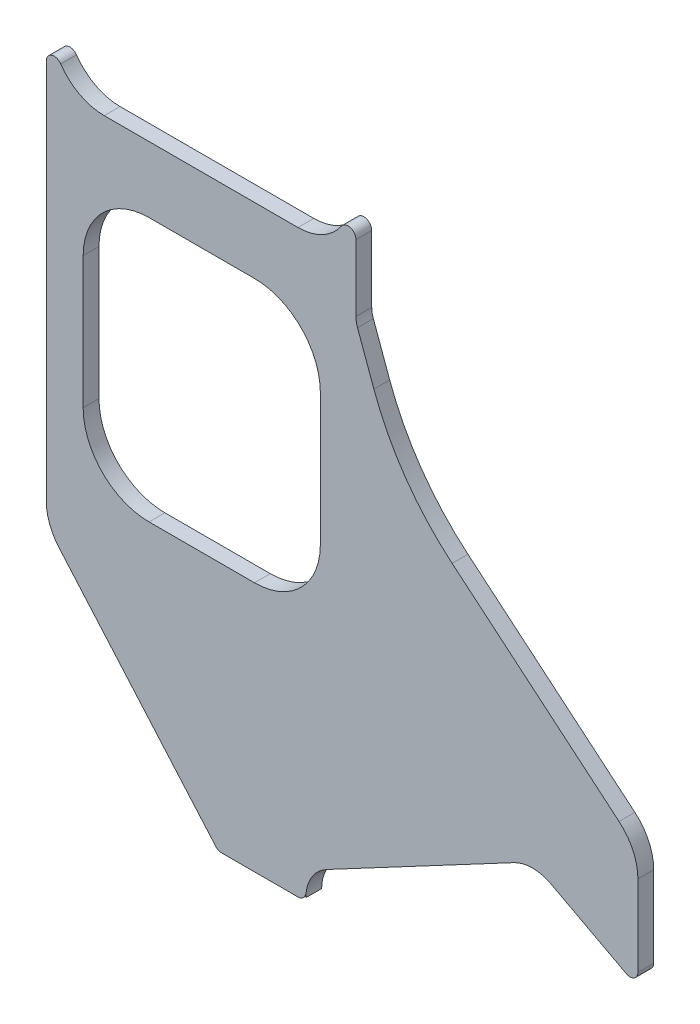
ISO-10303-21;
HEADER;
FILE_DESCRIPTION(('STEP AP214'),'2;1');
FILE_NAME('part.step','',(''),(''),'','','');
FILE_SCHEMA(('AUTOMOTIVE_DESIGN { 1 0 10303 214 1 1 1 1 }'));
ENDSEC;
DATA;
#1=APPLICATION_CONTEXT('core data for automotive mechanical design processes');
#2=APPLICATION_PROTOCOL_DEFINITION('international standard','automotive_design',2000,#1);
#3=PRODUCT_CONTEXT('',#1,'mechanical');
#4=PRODUCT('Part','Part','',(#3));
#5=PRODUCT_RELATED_PRODUCT_CATEGORY('part','',(#4));
#6=PRODUCT_DEFINITION_FORMATION('','',#4);
#7=PRODUCT_DEFINITION_CONTEXT('part definition',#1,'design');
#8=PRODUCT_DEFINITION('design','',#6,#7);
#9=PRODUCT_DEFINITION_SHAPE('','',#8);
#10=(LENGTH_UNIT() NAMED_UNIT(*) SI_UNIT(.MILLI.,.METRE.));
#11=(NAMED_UNIT(*) PLANE_ANGLE_UNIT() SI_UNIT($,.RADIAN.));
#12=(NAMED_UNIT(*) SI_UNIT($,.STERADIAN.) SOLID_ANGLE_UNIT());
#13=UNCERTAINTY_MEASURE_WITH_UNIT(LENGTH_MEASURE(1.E-05),#10,'distance_accuracy_value','');
#14=(GEOMETRIC_REPRESENTATION_CONTEXT(3) GLOBAL_UNCERTAINTY_ASSIGNED_CONTEXT((#13)) GLOBAL_UNIT_ASSIGNED_CONTEXT((#10,
#11,#12)) REPRESENTATION_CONTEXT('',''));
#15=CARTESIAN_POINT('',(0.,0.,0.));
#16=DIRECTION('',(0.,0.,1.));
#17=DIRECTION('',(1.,0.,0.));
#18=AXIS2_PLACEMENT_3D('',#15,#16,#17);
#19=CARTESIAN_POINT('',(-181.5,171.038518603184,6.));
#20=DIRECTION('',(0.,0.,1.));
#21=DIRECTION('',(1.,0.,0.));
#22=AXIS2_PLACEMENT_3D('',#19,#20,#21);
#23=PLANE('',#22);
#24=CARTESIAN_POINT('',(-181.5,171.038518603184,6.));
#25=DIRECTION('',(0.,0.,1.));
#26=DIRECTION('',(1.,0.,0.));
#27=AXIS2_PLACEMENT_3D('',#24,#25,#26);
#28=CIRCLE('',#27,3.00000000000003);
#29=CARTESIAN_POINT('',(-179.021739130435,172.729146611465,6.));
#30=VERTEX_POINT('',#29);
#31=CARTESIAN_POINT('',(-184.5,171.038518603184,6.));
#32=VERTEX_POINT('',#31);
#33=EDGE_CURVE('E313',#30,#32,#28,.T.);
#34=ORIENTED_EDGE('',*,*,#33,.T.);
#35=DIRECTION('',(0.,-1.,0.));
#36=VECTOR('',#35,1.);
#37=CARTESIAN_POINT('',(-184.5,26.4776935896962,6.));
#38=LINE('',#37,#36);
#39=CARTESIAN_POINT('',(-184.5,26.4776935896962,6.));
#40=VERTEX_POINT('',#39);
#41=EDGE_CURVE('E316',#32,#40,#38,.T.);
#42=ORIENTED_EDGE('',*,*,#41,.T.);
#43=CARTESIAN_POINT('',(-164.5,26.4776935896962,6.));
#44=DIRECTION('',(0.,0.,1.));
#45=DIRECTION('',(-1.,0.,0.));
#46=AXIS2_PLACEMENT_3D('',#43,#44,#45);
#47=CIRCLE('',#46,20.);
#48=CARTESIAN_POINT('',(-179.594191604455,13.356513009886,6.));
#49=VERTEX_POINT('',#48);
#50=EDGE_CURVE('E319',#40,#49,#47,.T.);
#51=ORIENTED_EDGE('',*,*,#50,.T.);
#52=DIRECTION('',(0.656059028990509,-0.754709580222771,0.));
#53=VECTOR('',#52,1.);
#54=CARTESIAN_POINT('',(-120.200444637853,-54.9681770869715,6.));
#55=LINE('',#54,#53);
#56=CARTESIAN_POINT('',(-120.200444637853,-54.9681770869715,6.));
#57=VERTEX_POINT('',#56);
#58=EDGE_CURVE('E321',#49,#57,#55,.T.);
#59=ORIENTED_EDGE('',*,*,#58,.T.);
#60=CARTESIAN_POINT('',(-117.936315897185,-53.,6.));
#61=DIRECTION('',(0.,0.,1.));
#62=DIRECTION('',(1.,0.,0.));
#63=AXIS2_PLACEMENT_3D('',#60,#61,#62);
#64=CIRCLE('',#63,3.);
#65=CARTESIAN_POINT('',(-117.936315897185,-56.,6.));
#66=VERTEX_POINT('',#65);
#67=EDGE_CURVE('E323',#57,#66,#64,.T.);
#68=ORIENTED_EDGE('',*,*,#67,.T.);
#69=DIRECTION('',(1.,0.,0.));
#70=VECTOR('',#69,1.);
#71=CARTESIAN_POINT('',(-117.936315897185,-56.,6.));
#72=LINE('',#71,#70);
#73=CARTESIAN_POINT('',(-89.,-56.,6.));
#74=VERTEX_POINT('',#73);
#75=EDGE_CURVE('E325',#66,#74,#72,.T.);
#76=ORIENTED_EDGE('',*,*,#75,.T.);
#77=CARTESIAN_POINT('',(-89.,-53.,6.));
#78=DIRECTION('',(0.,0.,1.));
#79=DIRECTION('',(1.,0.,0.));
#80=AXIS2_PLACEMENT_3D('',#77,#78,#79);
#81=CIRCLE('',#80,3.);
#82=CARTESIAN_POINT('',(-86.,-53.,6.));
#83=VERTEX_POINT('',#82);
#84=EDGE_CURVE('E327',#74,#83,#81,.T.);
#85=ORIENTED_EDGE('',*,*,#84,.T.);
#86=DIRECTION('',(0.,-1.,0.));
#87=VECTOR('',#86,1.);
#88=CARTESIAN_POINT('',(-86.,-53.,6.));
#89=LINE('',#88,#87);
#90=CARTESIAN_POINT('',(-86.,-54.7399204083003,6.));
#91=VERTEX_POINT('',#90);
#92=EDGE_CURVE('E329',#83,#91,#89,.T.);
#93=ORIENTED_EDGE('',*,*,#92,.T.);
#94=CARTESIAN_POINT('',(-71.,-54.7399204083003,6.));
#95=DIRECTION('',(0.,0.,-1.));
#96=DIRECTION('',(-1.,0.,0.));
#97=AXIS2_PLACEMENT_3D('',#94,#95,#96);
#98=CIRCLE('',#97,15.);
#99=CARTESIAN_POINT('',(-78.0420734417883,-41.4957065154164,6.));
#100=VERTEX_POINT('',#99);
#101=EDGE_CURVE('E331',#91,#100,#98,.T.);
#102=ORIENTED_EDGE('',*,*,#101,.T.);
#103=DIRECTION('',(0.882947592858928,0.469471562785889,0.));
#104=VECTOR('',#103,1.);
#105=CARTESIAN_POINT('',(-7.04207344178839,-3.74433686745167,6.));
#106=LINE('',#105,#104);
#107=CARTESIAN_POINT('',(-7.04207344178839,-3.74433686745168,6.));
#108=VERTEX_POINT('',#107);
#109=EDGE_CURVE('E333',#100,#108,#106,.T.);
#110=ORIENTED_EDGE('',*,*,#109,.T.);
#111=CARTESIAN_POINT('',(0.,-16.9885507603356,6.));
#112=DIRECTION('',(0.,0.,-1.));
#113=DIRECTION('',(-1.,0.,0.));
#114=AXIS2_PLACEMENT_3D('',#111,#112,#113);
#115=CIRCLE('',#114,15.);
#116=CARTESIAN_POINT('',(7.04207344178837,-3.74433686745173,6.));
#117=VERTEX_POINT('',#116);
#118=EDGE_CURVE('E335',#108,#117,#115,.T.);
#119=ORIENTED_EDGE('',*,*,#118,.T.);
#120=DIRECTION('',(0.882947592858925,-0.469471562785895,0.));
#121=VECTOR('',#120,1.);
#122=CARTESIAN_POINT('',(35.5915853116423,-18.9243815979846,6.));
#123=LINE('',#122,#121);
#124=CARTESIAN_POINT('',(35.5915853116423,-18.9243815979846,6.));
#125=VERTEX_POINT('',#124);
#126=EDGE_CURVE('E337',#117,#125,#123,.T.);
#127=ORIENTED_EDGE('',*,*,#126,.T.);
#128=CARTESIAN_POINT('',(37.,-16.2755388194078,6.));
#129=DIRECTION('',(0.,0.,1.));
#130=DIRECTION('',(-1.,0.,0.));
#131=AXIS2_PLACEMENT_3D('',#128,#129,#130);
#132=CIRCLE('',#131,3.);
#133=CARTESIAN_POINT('',(40.,-16.2755388194078,6.));
#134=VERTEX_POINT('',#133);
#135=EDGE_CURVE('E339',#125,#134,#132,.T.);
#136=ORIENTED_EDGE('',*,*,#135,.T.);
#137=DIRECTION('',(0.,1.,0.));
#138=VECTOR('',#137,1.);
#139=CARTESIAN_POINT('',(40.,14.4054695704407,6.));
#140=LINE('',#139,#138);
#141=CARTESIAN_POINT('',(40.,14.4054695704407,6.));
#142=VERTEX_POINT('',#141);
#143=EDGE_CURVE('E341',#134,#142,#140,.T.);
#144=ORIENTED_EDGE('',*,*,#143,.T.);
#145=CARTESIAN_POINT('',(20.,14.4054695704407,6.));
#146=DIRECTION('',(0.,0.,1.));
#147=DIRECTION('',(-1.,0.,0.));
#148=AXIS2_PLACEMENT_3D('',#145,#146,#147);
#149=CIRCLE('',#148,20.);
#150=CARTESIAN_POINT('',(32.8557521937309,29.7263584328202,6.));
#151=VERTEX_POINT('',#150);
#152=EDGE_CURVE('E343',#142,#151,#149,.T.);
#153=ORIENTED_EDGE('',*,*,#152,.T.);
#154=DIRECTION('',(-0.766044443118975,0.642787609686543,0.));
#155=VECTOR('',#154,1.);
#156=CARTESIAN_POINT('',(32.8557521937309,29.7263584328202,6.));
#157=LINE('',#156,#155);
#158=CARTESIAN_POINT('',(-30.4997490796203,82.8879361843415,6.));
#159=VERTEX_POINT('',#158);
#160=EDGE_CURVE('E345',#151,#159,#157,.T.);
#161=ORIENTED_EDGE('',*,*,#160,.T.);
#162=CARTESIAN_POINT('',(33.779011889034,159.492380496239,6.));
#163=DIRECTION('',(0.,0.,-1.));
#164=DIRECTION('',(-1.,0.,0.));
#165=AXIS2_PLACEMENT_3D('',#162,#163,#164);
#166=CIRCLE('',#165,100.);
#167=CARTESIAN_POINT('',(-60.1902501895567,125.290366163672,6.));
#168=VERTEX_POINT('',#167);
#169=EDGE_CURVE('E347',#159,#168,#166,.T.);
#170=ORIENTED_EDGE('',*,*,#169,.T.);
#171=DIRECTION('',(-0.342020143325673,0.939692620785907,0.));
#172=VECTOR('',#171,1.);
#173=CARTESIAN_POINT('',(-66.3969262078591,142.343068373828,6.));
#174=LINE('',#173,#172);
#175=CARTESIAN_POINT('',(-66.3969262078591,142.343068373828,6.));
#176=VERTEX_POINT('',#175);
#177=EDGE_CURVE('E349',#168,#176,#174,.T.);
#178=ORIENTED_EDGE('',*,*,#177,.T.);
#179=CARTESIAN_POINT('',(-57.,145.763269807085,6.));
#180=DIRECTION('',(0.,0.,-1.));
#181=DIRECTION('',(1.,0.,0.));
#182=AXIS2_PLACEMENT_3D('',#179,#180,#181);
#183=CIRCLE('',#182,10.);
#184=CARTESIAN_POINT('',(-67.,145.763269807085,6.));
#185=VERTEX_POINT('',#184);
#186=EDGE_CURVE('E351',#176,#185,#183,.T.);
#187=ORIENTED_EDGE('',*,*,#186,.T.);
#188=DIRECTION('',(0.,1.,0.));
#189=VECTOR('',#188,1.);
#190=CARTESIAN_POINT('',(-67.,171.038518603184,6.));
#191=LINE('',#190,#189);
#192=CARTESIAN_POINT('',(-67.,171.038518603184,6.));
#193=VERTEX_POINT('',#192);
#194=EDGE_CURVE('E353',#185,#193,#191,.T.);
#195=ORIENTED_EDGE('',*,*,#194,.T.);
#196=CARTESIAN_POINT('',(-70.,171.038518603184,6.));
#197=DIRECTION('',(0.,0.,1.));
#198=DIRECTION('',(-1.,0.,0.));
#199=AXIS2_PLACEMENT_3D('',#196,#197,#198);
#200=CIRCLE('',#199,3.00000000000001);
#201=CARTESIAN_POINT('',(-72.4782608695653,172.729146611465,6.));
#202=VERTEX_POINT('',#201);
#203=EDGE_CURVE('E355',#193,#202,#200,.T.);
#204=ORIENTED_EDGE('',*,*,#203,.T.);
#205=CARTESIAN_POINT('',(-89.,184.,6.));
#206=DIRECTION('',(0.,0.,-1.));
#207=DIRECTION('',(1.,0.,0.));
#208=AXIS2_PLACEMENT_3D('',#205,#206,#207);
#209=CIRCLE('',#208,20.);
#210=CARTESIAN_POINT('',(-89.,164.,6.));
#211=VERTEX_POINT('',#210);
#212=EDGE_CURVE('E357',#202,#211,#209,.T.);
#213=ORIENTED_EDGE('',*,*,#212,.T.);
#214=DIRECTION('',(-1.,0.,0.));
#215=VECTOR('',#214,1.);
#216=CARTESIAN_POINT('',(-162.5,164.,6.));
#217=LINE('',#216,#215);
#218=CARTESIAN_POINT('',(-162.5,164.,6.));
#219=VERTEX_POINT('',#218);
#220=EDGE_CURVE('E359',#211,#219,#217,.T.);
#221=ORIENTED_EDGE('',*,*,#220,.T.);
#222=CARTESIAN_POINT('',(-162.5,184.,6.));
#223=DIRECTION('',(0.,0.,-1.));
#224=DIRECTION('',(-1.,0.,0.));
#225=AXIS2_PLACEMENT_3D('',#222,#223,#224);
#226=CIRCLE('',#225,20.);
#227=EDGE_CURVE('E361',#219,#30,#226,.T.);
#228=ORIENTED_EDGE('',*,*,#227,.T.);
#229=EDGE_LOOP('',(#34,#42,#51,#59,#68,#76,#85,#93,#102,#110,#119,#127,#136,#144,#153,#161,#170,
#178,#187,#195,#204,#213,#221,#228));
#230=FACE_BOUND('',#229,.T.);
#231=DIRECTION('',(-1.,0.,0.));
#232=VECTOR('',#231,1.);
#233=CARTESIAN_POINT('',(-145.5,139.,6.));
#234=LINE('',#233,#232);
#235=CARTESIAN_POINT('',(-105.5,139.,6.));
#236=VERTEX_POINT('',#235);
#237=CARTESIAN_POINT('',(-145.5,139.,6.));
#238=VERTEX_POINT('',#237);
#239=EDGE_CURVE('E256',#236,#238,#234,.T.);
#240=ORIENTED_EDGE('',*,*,#239,.F.);
#241=CARTESIAN_POINT('',(-105.5,114.,6.));
#242=DIRECTION('',(0.,0.,1.));
#243=DIRECTION('',(-1.,0.,0.));
#244=AXIS2_PLACEMENT_3D('',#241,#242,#243);
#245=CIRCLE('',#244,25.);
#246=CARTESIAN_POINT('',(-80.5,114.,6.));
#247=VERTEX_POINT('',#246);
#248=EDGE_CURVE('E248',#247,#236,#245,.T.);
#249=ORIENTED_EDGE('',*,*,#248,.F.);
#250=DIRECTION('',(0.,1.,0.));
#251=VECTOR('',#250,1.);
#252=CARTESIAN_POINT('',(-80.5,114.,6.));
#253=LINE('',#252,#251);
#254=CARTESIAN_POINT('',(-80.5,64.,6.));
#255=VERTEX_POINT('',#254);
#256=EDGE_CURVE('E281',#255,#247,#253,.T.);
#257=ORIENTED_EDGE('',*,*,#256,.F.);
#258=CARTESIAN_POINT('',(-105.5,64.,6.));
#259=DIRECTION('',(0.,0.,1.));
#260=DIRECTION('',(1.,0.,0.));
#261=AXIS2_PLACEMENT_3D('',#258,#259,#260);
#262=CIRCLE('',#261,25.);
#263=CARTESIAN_POINT('',(-105.5,39.,6.));
#264=VERTEX_POINT('',#263);
#265=EDGE_CURVE('E279',#264,#255,#262,.T.);
#266=ORIENTED_EDGE('',*,*,#265,.F.);
#267=DIRECTION('',(1.,0.,0.));
#268=VECTOR('',#267,1.);
#269=CARTESIAN_POINT('',(-145.5,39.,6.));
#270=LINE('',#269,#268);
#271=CARTESIAN_POINT('',(-145.5,39.,6.));
#272=VERTEX_POINT('',#271);
#273=EDGE_CURVE('E277',#272,#264,#270,.T.);
#274=ORIENTED_EDGE('',*,*,#273,.F.);
#275=CARTESIAN_POINT('',(-145.5,64.,6.));
#276=DIRECTION('',(0.,0.,1.));
#277=DIRECTION('',(1.,0.,0.));
#278=AXIS2_PLACEMENT_3D('',#275,#276,#277);
#279=CIRCLE('',#278,25.);
#280=CARTESIAN_POINT('',(-170.5,64.,6.));
#281=VERTEX_POINT('',#280);
#282=EDGE_CURVE('E275',#281,#272,#279,.T.);
#283=ORIENTED_EDGE('',*,*,#282,.F.);
#284=DIRECTION('',(0.,-1.,0.));
#285=VECTOR('',#284,1.);
#286=CARTESIAN_POINT('',(-170.5,114.,6.));
#287=LINE('',#286,#285);
#288=CARTESIAN_POINT('',(-170.5,114.,6.));
#289=VERTEX_POINT('',#288);
#290=EDGE_CURVE('E271',#289,#281,#287,.T.);
#291=ORIENTED_EDGE('',*,*,#290,.F.);
#292=CARTESIAN_POINT('',(-145.5,114.,6.));
#293=DIRECTION('',(0.,0.,1.));
#294=DIRECTION('',(1.,0.,0.));
#295=AXIS2_PLACEMENT_3D('',#292,#293,#294);
#296=CIRCLE('',#295,25.);
#297=EDGE_CURVE('E269',#238,#289,#296,.T.);
#298=ORIENTED_EDGE('',*,*,#297,.F.);
#299=EDGE_LOOP('',(#240,#249,#257,#266,#274,#283,#291,#298));
#300=FACE_BOUND('',#299,.T.);
#301=ADVANCED_FACE('F39',(#230,#300),#23,.T.);
#302=CARTESIAN_POINT('',(-181.5,171.038518603184,0.));
#303=DIRECTION('',(0.,0.,1.));
#304=DIRECTION('',(1.,0.,0.));
#305=AXIS2_PLACEMENT_3D('',#302,#303,#304);
#306=PLANE('',#305);
#307=CARTESIAN_POINT('',(-181.5,171.038518603184,0.));
#308=DIRECTION('',(0.,0.,1.));
#309=DIRECTION('',(1.,0.,0.));
#310=AXIS2_PLACEMENT_3D('',#307,#308,#309);
#311=CIRCLE('',#310,3.00000000000003);
#312=CARTESIAN_POINT('',(-179.021739130435,172.729146611465,0.));
#313=VERTEX_POINT('',#312);
#314=CARTESIAN_POINT('',(-184.5,171.038518603184,0.));
#315=VERTEX_POINT('',#314);
#316=EDGE_CURVE('E264',#313,#315,#311,.T.);
#317=ORIENTED_EDGE('',*,*,#316,.F.);
#318=CARTESIAN_POINT('',(-162.5,184.,0.));
#319=DIRECTION('',(0.,0.,-1.));
#320=DIRECTION('',(-1.,0.,0.));
#321=AXIS2_PLACEMENT_3D('',#318,#319,#320);
#322=CIRCLE('',#321,20.);
#323=CARTESIAN_POINT('',(-162.5,164.,0.));
#324=VERTEX_POINT('',#323);
#325=EDGE_CURVE('E317',#324,#313,#322,.T.);
#326=ORIENTED_EDGE('',*,*,#325,.F.);
#327=DIRECTION('',(-1.,0.,0.));
#328=VECTOR('',#327,1.);
#329=CARTESIAN_POINT('',(-162.5,164.,0.));
#330=LINE('',#329,#328);
#331=CARTESIAN_POINT('',(-89.,164.,0.));
#332=VERTEX_POINT('',#331);
#333=EDGE_CURVE('E408',#332,#324,#330,.T.);
#334=ORIENTED_EDGE('',*,*,#333,.F.);
#335=CARTESIAN_POINT('',(-89.,184.,0.));
#336=DIRECTION('',(0.,0.,-1.));
#337=DIRECTION('',(1.,0.,0.));
#338=AXIS2_PLACEMENT_3D('',#335,#336,#337);
#339=CIRCLE('',#338,20.);
#340=CARTESIAN_POINT('',(-72.4782608695653,172.729146611465,0.));
#341=VERTEX_POINT('',#340);
#342=EDGE_CURVE('E406',#341,#332,#339,.T.);
#343=ORIENTED_EDGE('',*,*,#342,.F.);
#344=CARTESIAN_POINT('',(-70.,171.038518603184,0.));
#345=DIRECTION('',(0.,0.,1.));
#346=DIRECTION('',(-1.,0.,0.));
#347=AXIS2_PLACEMENT_3D('',#344,#345,#346);
#348=CIRCLE('',#347,3.00000000000001);
#349=CARTESIAN_POINT('',(-67.,171.038518603184,0.));
#350=VERTEX_POINT('',#349);
#351=EDGE_CURVE('E404',#350,#341,#348,.T.);
#352=ORIENTED_EDGE('',*,*,#351,.F.);
#353=DIRECTION('',(0.,1.,0.));
#354=VECTOR('',#353,1.);
#355=CARTESIAN_POINT('',(-67.,171.038518603184,0.));
#356=LINE('',#355,#354);
#357=CARTESIAN_POINT('',(-67.,145.763269807085,0.));
#358=VERTEX_POINT('',#357);
#359=EDGE_CURVE('E402',#358,#350,#356,.T.);
#360=ORIENTED_EDGE('',*,*,#359,.F.);
#361=CARTESIAN_POINT('',(-57.,145.763269807085,0.));
#362=DIRECTION('',(0.,0.,-1.));
#363=DIRECTION('',(1.,0.,0.));
#364=AXIS2_PLACEMENT_3D('',#361,#362,#363);
#365=CIRCLE('',#364,10.);
#366=CARTESIAN_POINT('',(-66.3969262078591,142.343068373828,0.));
#367=VERTEX_POINT('',#366);
#368=EDGE_CURVE('E400',#367,#358,#365,.T.);
#369=ORIENTED_EDGE('',*,*,#368,.F.);
#370=DIRECTION('',(-0.342020143325673,0.939692620785907,0.));
#371=VECTOR('',#370,1.);
#372=CARTESIAN_POINT('',(-66.3969262078591,142.343068373828,0.));
#373=LINE('',#372,#371);
#374=CARTESIAN_POINT('',(-60.1902501895567,125.290366163672,0.));
#375=VERTEX_POINT('',#374);
#376=EDGE_CURVE('E398',#375,#367,#373,.T.);
#377=ORIENTED_EDGE('',*,*,#376,.F.);
#378=CARTESIAN_POINT('',(33.779011889034,159.492380496239,0.));
#379=DIRECTION('',(0.,0.,-1.));
#380=DIRECTION('',(-1.,0.,0.));
#381=AXIS2_PLACEMENT_3D('',#378,#379,#380);
#382=CIRCLE('',#381,100.);
#383=CARTESIAN_POINT('',(-30.4997490796203,82.8879361843415,0.));
#384=VERTEX_POINT('',#383);
#385=EDGE_CURVE('E396',#384,#375,#382,.T.);
#386=ORIENTED_EDGE('',*,*,#385,.F.);
#387=DIRECTION('',(-0.766044443118975,0.642787609686543,0.));
#388=VECTOR('',#387,1.);
#389=CARTESIAN_POINT('',(32.8557521937309,29.7263584328202,0.));
#390=LINE('',#389,#388);
#391=CARTESIAN_POINT('',(32.8557521937309,29.7263584328202,0.));
#392=VERTEX_POINT('',#391);
#393=EDGE_CURVE('E394',#392,#384,#390,.T.);
#394=ORIENTED_EDGE('',*,*,#393,.F.);
#395=CARTESIAN_POINT('',(20.,14.4054695704407,0.));
#396=DIRECTION('',(0.,0.,1.));
#397=DIRECTION('',(-1.,0.,0.));
#398=AXIS2_PLACEMENT_3D('',#395,#396,#397);
#399=CIRCLE('',#398,20.);
#400=CARTESIAN_POINT('',(40.,14.4054695704407,0.));
#401=VERTEX_POINT('',#400);
#402=EDGE_CURVE('E392',#401,#392,#399,.T.);
#403=ORIENTED_EDGE('',*,*,#402,.F.);
#404=DIRECTION('',(0.,1.,0.));
#405=VECTOR('',#404,1.);
#406=CARTESIAN_POINT('',(40.,14.4054695704407,0.));
#407=LINE('',#406,#405);
#408=CARTESIAN_POINT('',(40.,-16.2755388194078,0.));
#409=VERTEX_POINT('',#408);
#410=EDGE_CURVE('E390',#409,#401,#407,.T.);
#411=ORIENTED_EDGE('',*,*,#410,.F.);
#412=CARTESIAN_POINT('',(37.,-16.2755388194078,0.));
#413=DIRECTION('',(0.,0.,1.));
#414=DIRECTION('',(-1.,0.,0.));
#415=AXIS2_PLACEMENT_3D('',#412,#413,#414);
#416=CIRCLE('',#415,3.);
#417=CARTESIAN_POINT('',(35.5915853116423,-18.9243815979846,0.));
#418=VERTEX_POINT('',#417);
#419=EDGE_CURVE('E388',#418,#409,#416,.T.);
#420=ORIENTED_EDGE('',*,*,#419,.F.);
#421=DIRECTION('',(0.882947592858925,-0.469471562785895,0.));
#422=VECTOR('',#421,1.);
#423=CARTESIAN_POINT('',(35.5915853116423,-18.9243815979846,0.));
#424=LINE('',#423,#422);
#425=CARTESIAN_POINT('',(7.04207344178837,-3.74433686745173,0.));
#426=VERTEX_POINT('',#425);
#427=EDGE_CURVE('E386',#426,#418,#424,.T.);
#428=ORIENTED_EDGE('',*,*,#427,.F.);
#429=CARTESIAN_POINT('',(0.,-16.9885507603356,0.));
#430=DIRECTION('',(0.,0.,-1.));
#431=DIRECTION('',(-1.,0.,0.));
#432=AXIS2_PLACEMENT_3D('',#429,#430,#431);
#433=CIRCLE('',#432,15.);
#434=CARTESIAN_POINT('',(-7.04207344178839,-3.74433686745168,0.));
#435=VERTEX_POINT('',#434);
#436=EDGE_CURVE('E384',#435,#426,#433,.T.);
#437=ORIENTED_EDGE('',*,*,#436,.F.);
#438=DIRECTION('',(0.882947592858928,0.469471562785889,0.));
#439=VECTOR('',#438,1.);
#440=CARTESIAN_POINT('',(-7.04207344178839,-3.74433686745167,0.));
#441=LINE('',#440,#439);
#442=CARTESIAN_POINT('',(-78.0420734417883,-41.4957065154164,0.));
#443=VERTEX_POINT('',#442);
#444=EDGE_CURVE('E382',#443,#435,#441,.T.);
#445=ORIENTED_EDGE('',*,*,#444,.F.);
#446=CARTESIAN_POINT('',(-71.,-54.7399204083003,0.));
#447=DIRECTION('',(0.,0.,-1.));
#448=DIRECTION('',(-1.,0.,0.));
#449=AXIS2_PLACEMENT_3D('',#446,#447,#448);
#450=CIRCLE('',#449,15.);
#451=CARTESIAN_POINT('',(-86.,-54.7399204083003,0.));
#452=VERTEX_POINT('',#451);
#453=EDGE_CURVE('E380',#452,#443,#450,.T.);
#454=ORIENTED_EDGE('',*,*,#453,.F.);
#455=DIRECTION('',(0.,-1.,0.));
#456=VECTOR('',#455,1.);
#457=CARTESIAN_POINT('',(-86.,-53.,0.));
#458=LINE('',#457,#456);
#459=CARTESIAN_POINT('',(-86.,-53.,0.));
#460=VERTEX_POINT('',#459);
#461=EDGE_CURVE('E378',#460,#452,#458,.T.);
#462=ORIENTED_EDGE('',*,*,#461,.F.);
#463=CARTESIAN_POINT('',(-89.,-53.,0.));
#464=DIRECTION('',(0.,0.,1.));
#465=DIRECTION('',(1.,0.,0.));
#466=AXIS2_PLACEMENT_3D('',#463,#464,#465);
#467=CIRCLE('',#466,3.);
#468=CARTESIAN_POINT('',(-89.,-56.,0.));
#469=VERTEX_POINT('',#468);
#470=EDGE_CURVE('E376',#469,#460,#467,.T.);
#471=ORIENTED_EDGE('',*,*,#470,.F.);
#472=DIRECTION('',(1.,0.,0.));
#473=VECTOR('',#472,1.);
#474=CARTESIAN_POINT('',(-117.936315897185,-56.,0.));
#475=LINE('',#474,#473);
#476=CARTESIAN_POINT('',(-117.936315897185,-56.,0.));
#477=VERTEX_POINT('',#476);
#478=EDGE_CURVE('E374',#477,#469,#475,.T.);
#479=ORIENTED_EDGE('',*,*,#478,.F.);
#480=CARTESIAN_POINT('',(-117.936315897185,-53.,0.));
#481=DIRECTION('',(0.,0.,1.));
#482=DIRECTION('',(1.,0.,0.));
#483=AXIS2_PLACEMENT_3D('',#480,#481,#482);
#484=CIRCLE('',#483,3.);
#485=CARTESIAN_POINT('',(-120.200444637853,-54.9681770869715,0.));
#486=VERTEX_POINT('',#485);
#487=EDGE_CURVE('E372',#486,#477,#484,.T.);
#488=ORIENTED_EDGE('',*,*,#487,.F.);
#489=DIRECTION('',(0.656059028990509,-0.754709580222771,0.));
#490=VECTOR('',#489,1.);
#491=CARTESIAN_POINT('',(-120.200444637853,-54.9681770869715,0.));
#492=LINE('',#491,#490);
#493=CARTESIAN_POINT('',(-179.594191604455,13.356513009886,0.));
#494=VERTEX_POINT('',#493);
#495=EDGE_CURVE('E370',#494,#486,#492,.T.);
#496=ORIENTED_EDGE('',*,*,#495,.F.);
#497=CARTESIAN_POINT('',(-164.5,26.4776935896962,0.));
#498=DIRECTION('',(0.,0.,1.));
#499=DIRECTION('',(-1.,0.,0.));
#500=AXIS2_PLACEMENT_3D('',#497,#498,#499);
#501=CIRCLE('',#500,20.);
#502=CARTESIAN_POINT('',(-184.5,26.4776935896962,0.));
#503=VERTEX_POINT('',#502);
#504=EDGE_CURVE('E368',#503,#494,#501,.T.);
#505=ORIENTED_EDGE('',*,*,#504,.F.);
#506=DIRECTION('',(0.,-1.,0.));
#507=VECTOR('',#506,1.);
#508=CARTESIAN_POINT('',(-184.5,26.4776935896962,0.));
#509=LINE('',#508,#507);
#510=EDGE_CURVE('E366',#315,#503,#509,.T.);
#511=ORIENTED_EDGE('',*,*,#510,.F.);
#512=EDGE_LOOP('',(#317,#326,#334,#343,#352,#360,#369,#377,#386,#394,#403,#411,#420,#428,#437,
#445,#454,#462,#471,#479,#488,#496,#505,#511));
#513=FACE_BOUND('',#512,.T.);
#514=CARTESIAN_POINT('',(-105.5,114.,0.));
#515=DIRECTION('',(0.,0.,1.));
#516=DIRECTION('',(-1.,0.,0.));
#517=AXIS2_PLACEMENT_3D('',#514,#515,#516);
#518=CIRCLE('',#517,25.);
#519=CARTESIAN_POINT('',(-80.5,114.,0.));
#520=VERTEX_POINT('',#519);
#521=CARTESIAN_POINT('',(-105.5,139.,0.));
#522=VERTEX_POINT('',#521);
#523=EDGE_CURVE('E62',#520,#522,#518,.T.);
#524=ORIENTED_EDGE('',*,*,#523,.T.);
#525=DIRECTION('',(-1.,0.,0.));
#526=VECTOR('',#525,1.);
#527=CARTESIAN_POINT('',(-145.5,139.,0.));
#528=LINE('',#527,#526);
#529=CARTESIAN_POINT('',(-145.5,139.,0.));
#530=VERTEX_POINT('',#529);
#531=EDGE_CURVE('E263',#522,#530,#528,.T.);
#532=ORIENTED_EDGE('',*,*,#531,.T.);
#533=CARTESIAN_POINT('',(-145.5,114.,0.));
#534=DIRECTION('',(0.,0.,1.));
#535=DIRECTION('',(1.,0.,0.));
#536=AXIS2_PLACEMENT_3D('',#533,#534,#535);
#537=CIRCLE('',#536,25.);
#538=CARTESIAN_POINT('',(-170.5,114.,0.));
#539=VERTEX_POINT('',#538);
#540=EDGE_CURVE('E285',#530,#539,#537,.T.);
#541=ORIENTED_EDGE('',*,*,#540,.T.);
#542=DIRECTION('',(0.,-1.,0.));
#543=VECTOR('',#542,1.);
#544=CARTESIAN_POINT('',(-170.5,114.,0.));
#545=LINE('',#544,#543);
#546=CARTESIAN_POINT('',(-170.5,64.,0.));
#547=VERTEX_POINT('',#546);
#548=EDGE_CURVE('E288',#539,#547,#545,.T.);
#549=ORIENTED_EDGE('',*,*,#548,.T.);
#550=CARTESIAN_POINT('',(-145.5,64.,0.));
#551=DIRECTION('',(0.,0.,1.));
#552=DIRECTION('',(1.,0.,0.));
#553=AXIS2_PLACEMENT_3D('',#550,#551,#552);
#554=CIRCLE('',#553,25.);
#555=CARTESIAN_POINT('',(-145.5,39.,0.));
#556=VERTEX_POINT('',#555);
#557=EDGE_CURVE('E291',#547,#556,#554,.T.);
#558=ORIENTED_EDGE('',*,*,#557,.T.);
#559=DIRECTION('',(1.,0.,0.));
#560=VECTOR('',#559,1.);
#561=CARTESIAN_POINT('',(-145.5,39.,0.));
#562=LINE('',#561,#560);
#563=CARTESIAN_POINT('',(-105.5,39.,0.));
#564=VERTEX_POINT('',#563);
#565=EDGE_CURVE('E294',#556,#564,#562,.T.);
#566=ORIENTED_EDGE('',*,*,#565,.T.);
#567=CARTESIAN_POINT('',(-105.5,64.,0.));
#568=DIRECTION('',(0.,0.,1.));
#569=DIRECTION('',(1.,0.,0.));
#570=AXIS2_PLACEMENT_3D('',#567,#568,#569);
#571=CIRCLE('',#570,25.);
#572=CARTESIAN_POINT('',(-80.5,64.,0.));
#573=VERTEX_POINT('',#572);
#574=EDGE_CURVE('E297',#564,#573,#571,.T.);
#575=ORIENTED_EDGE('',*,*,#574,.T.);
#576=DIRECTION('',(0.,1.,0.));
#577=VECTOR('',#576,1.);
#578=CARTESIAN_POINT('',(-80.5,114.,0.));
#579=LINE('',#578,#577);
#580=EDGE_CURVE('E257',#573,#520,#579,.T.);
#581=ORIENTED_EDGE('',*,*,#580,.T.);
#582=EDGE_LOOP('',(#524,#532,#541,#549,#558,#566,#575,#581));
#583=FACE_BOUND('',#582,.T.);
#584=ADVANCED_FACE('F486',(#513,#583),#306,.F.);
#585=CARTESIAN_POINT('',(-181.5,171.038518603184,6.));
#586=DIRECTION('',(0.,0.,-1.));
#587=DIRECTION('',(-1.,0.,0.));
#588=AXIS2_PLACEMENT_3D('',#585,#586,#587);
#589=CYLINDRICAL_SURFACE('',#588,3.00000000000003);
#590=ORIENTED_EDGE('',*,*,#316,.T.);
#591=DIRECTION('',(0.,0.,-1.));
#592=VECTOR('',#591,1.);
#593=CARTESIAN_POINT('',(-184.5,171.038518603184,6.));
#594=LINE('',#593,#592);
#595=EDGE_CURVE('E11',#32,#315,#594,.T.);
#596=ORIENTED_EDGE('',*,*,#595,.F.);
#597=ORIENTED_EDGE('',*,*,#33,.F.);
#598=DIRECTION('',(0.,0.,-1.));
#599=VECTOR('',#598,1.);
#600=CARTESIAN_POINT('',(-179.021739130435,172.729146611465,6.));
#601=LINE('',#600,#599);
#602=EDGE_CURVE('E363',#30,#313,#601,.T.);
#603=ORIENTED_EDGE('',*,*,#602,.T.);
#604=EDGE_LOOP('',(#590,#596,#597,#603));
#605=FACE_BOUND('',#604,.T.);
#606=ADVANCED_FACE('F41',(#605),#589,.T.);
#607=CARTESIAN_POINT('',(-184.5,26.4776935896962,6.));
#608=DIRECTION('',(1.,0.,0.));
#609=DIRECTION('',(0.,1.,0.));
#610=AXIS2_PLACEMENT_3D('',#607,#608,#609);
#611=PLANE('',#610);
#612=ORIENTED_EDGE('',*,*,#510,.T.);
#613=DIRECTION('',(0.,0.,-1.));
#614=VECTOR('',#613,1.);
#615=CARTESIAN_POINT('',(-184.5,26.4776935896962,6.));
#616=LINE('',#615,#614);
#617=EDGE_CURVE('E47',#40,#503,#616,.T.);
#618=ORIENTED_EDGE('',*,*,#617,.F.);
#619=ORIENTED_EDGE('',*,*,#41,.F.);
#620=ORIENTED_EDGE('',*,*,#595,.T.);
#621=EDGE_LOOP('',(#612,#618,#619,#620));
#622=FACE_BOUND('',#621,.T.);
#623=ADVANCED_FACE('F503',(#622),#611,.F.);
#624=CARTESIAN_POINT('',(-164.5,26.4776935896962,6.));
#625=DIRECTION('',(0.,0.,-1.));
#626=DIRECTION('',(-1.,0.,0.));
#627=AXIS2_PLACEMENT_3D('',#624,#625,#626);
#628=CYLINDRICAL_SURFACE('',#627,20.);
#629=ORIENTED_EDGE('',*,*,#504,.T.);
#630=DIRECTION('',(0.,0.,-1.));
#631=VECTOR('',#630,1.);
#632=CARTESIAN_POINT('',(-179.594191604455,13.356513009886,6.));
#633=LINE('',#632,#631);
#634=EDGE_CURVE('E473',#49,#494,#633,.T.);
#635=ORIENTED_EDGE('',*,*,#634,.F.);
#636=ORIENTED_EDGE('',*,*,#50,.F.);
#637=ORIENTED_EDGE('',*,*,#617,.T.);
#638=EDGE_LOOP('',(#629,#635,#636,#637));
#639=FACE_BOUND('',#638,.T.);
#640=ADVANCED_FACE('F480',(#639),#628,.T.);
#641=CARTESIAN_POINT('',(-120.200444637853,-54.9681770869715,6.));
#642=DIRECTION('',(0.754709580222771,0.656059028990509,0.));
#643=DIRECTION('',(-0.656059028990509,0.754709580222771,0.));
#644=AXIS2_PLACEMENT_3D('',#641,#642,#643);
#645=PLANE('',#644);
#646=ORIENTED_EDGE('',*,*,#495,.T.);
#647=DIRECTION('',(0.,0.,-1.));
#648=VECTOR('',#647,1.);
#649=CARTESIAN_POINT('',(-120.200444637853,-54.9681770869715,6.));
#650=LINE('',#649,#648);
#651=EDGE_CURVE('E470',#57,#486,#650,.T.);
#652=ORIENTED_EDGE('',*,*,#651,.F.);
#653=ORIENTED_EDGE('',*,*,#58,.F.);
#654=ORIENTED_EDGE('',*,*,#634,.T.);
#655=EDGE_LOOP('',(#646,#652,#653,#654));
#656=FACE_BOUND('',#655,.T.);
#657=ADVANCED_FACE('F492',(#656),#645,.F.);
#658=CARTESIAN_POINT('',(-117.936315897185,-53.,6.));
#659=DIRECTION('',(0.,0.,-1.));
#660=DIRECTION('',(-1.,0.,0.));
#661=AXIS2_PLACEMENT_3D('',#658,#659,#660);
#662=CYLINDRICAL_SURFACE('',#661,3.);
#663=ORIENTED_EDGE('',*,*,#487,.T.);
#664=DIRECTION('',(0.,0.,-1.));
#665=VECTOR('',#664,1.);
#666=CARTESIAN_POINT('',(-117.936315897185,-56.,6.));
#667=LINE('',#666,#665);
#668=EDGE_CURVE('E467',#66,#477,#667,.T.);
#669=ORIENTED_EDGE('',*,*,#668,.F.);
#670=ORIENTED_EDGE('',*,*,#67,.F.);
#671=ORIENTED_EDGE('',*,*,#651,.T.);
#672=EDGE_LOOP('',(#663,#669,#670,#671));
#673=FACE_BOUND('',#672,.T.);
#674=ADVANCED_FACE('F496',(#673),#662,.T.);
#675=CARTESIAN_POINT('',(-117.936315897185,-56.,6.));
#676=DIRECTION('',(0.,1.,0.));
#677=DIRECTION('',(0.,0.,1.));
#678=AXIS2_PLACEMENT_3D('',#675,#676,#677);
#679=PLANE('',#678);
#680=ORIENTED_EDGE('',*,*,#478,.T.);
#681=DIRECTION('',(0.,0.,-1.));
#682=VECTOR('',#681,1.);
#683=CARTESIAN_POINT('',(-89.,-56.,6.));
#684=LINE('',#683,#682);
#685=EDGE_CURVE('E464',#74,#469,#684,.T.);
#686=ORIENTED_EDGE('',*,*,#685,.F.);
#687=ORIENTED_EDGE('',*,*,#75,.F.);
#688=ORIENTED_EDGE('',*,*,#668,.T.);
#689=EDGE_LOOP('',(#680,#686,#687,#688));
#690=FACE_BOUND('',#689,.T.);
#691=ADVANCED_FACE('F596',(#690),#679,.F.);
#692=CARTESIAN_POINT('',(-89.,-53.,6.));
#693=DIRECTION('',(0.,0.,-1.));
#694=DIRECTION('',(-1.,0.,0.));
#695=AXIS2_PLACEMENT_3D('',#692,#693,#694);
#696=CYLINDRICAL_SURFACE('',#695,3.);
#697=ORIENTED_EDGE('',*,*,#470,.T.);
#698=DIRECTION('',(0.,0.,-1.));
#699=VECTOR('',#698,1.);
#700=CARTESIAN_POINT('',(-86.,-53.,6.));
#701=LINE('',#700,#699);
#702=EDGE_CURVE('E461',#83,#460,#701,.T.);
#703=ORIENTED_EDGE('',*,*,#702,.F.);
#704=ORIENTED_EDGE('',*,*,#84,.F.);
#705=ORIENTED_EDGE('',*,*,#685,.T.);
#706=EDGE_LOOP('',(#697,#703,#704,#705));
#707=FACE_BOUND('',#706,.T.);
#708=ADVANCED_FACE('F594',(#707),#696,.T.);
#709=CARTESIAN_POINT('',(-86.,-53.,6.));
#710=DIRECTION('',(1.,0.,0.));
#711=DIRECTION('',(0.,0.,-1.));
#712=AXIS2_PLACEMENT_3D('',#709,#710,#711);
#713=PLANE('',#712);
#714=ORIENTED_EDGE('',*,*,#461,.T.);
#715=DIRECTION('',(0.,0.,-1.));
#716=VECTOR('',#715,1.);
#717=CARTESIAN_POINT('',(-86.,-54.7399204083003,6.));
#718=LINE('',#717,#716);
#719=EDGE_CURVE('E458',#91,#452,#718,.T.);
#720=ORIENTED_EDGE('',*,*,#719,.F.);
#721=ORIENTED_EDGE('',*,*,#92,.F.);
#722=ORIENTED_EDGE('',*,*,#702,.T.);
#723=EDGE_LOOP('',(#714,#720,#721,#722));
#724=FACE_BOUND('',#723,.T.);
#725=ADVANCED_FACE('F590',(#724),#713,.F.);
#726=CARTESIAN_POINT('',(-71.,-54.7399204083003,6.));
#727=DIRECTION('',(0.,0.,-1.));
#728=DIRECTION('',(-1.,0.,0.));
#729=AXIS2_PLACEMENT_3D('',#726,#727,#728);
#730=CYLINDRICAL_SURFACE('',#729,15.);
#731=ORIENTED_EDGE('',*,*,#453,.T.);
#732=DIRECTION('',(0.,0.,-1.));
#733=VECTOR('',#732,1.);
#734=CARTESIAN_POINT('',(-78.0420734417883,-41.4957065154164,6.));
#735=LINE('',#734,#733);
#736=EDGE_CURVE('E455',#100,#443,#735,.T.);
#737=ORIENTED_EDGE('',*,*,#736,.F.);
#738=ORIENTED_EDGE('',*,*,#101,.F.);
#739=ORIENTED_EDGE('',*,*,#719,.T.);
#740=EDGE_LOOP('',(#731,#737,#738,#739));
#741=FACE_BOUND('',#740,.T.);
#742=ADVANCED_FACE('F585',(#741),#730,.F.);
#743=CARTESIAN_POINT('',(-7.04207344178839,-3.74433686745167,6.));
#744=DIRECTION('',(-0.469471562785889,0.882947592858928,0.));
#745=DIRECTION('',(-0.882947592858928,-0.469471562785889,0.));
#746=AXIS2_PLACEMENT_3D('',#743,#744,#745);
#747=PLANE('',#746);
#748=ORIENTED_EDGE('',*,*,#444,.T.);
#749=DIRECTION('',(0.,0.,-1.));
#750=VECTOR('',#749,1.);
#751=CARTESIAN_POINT('',(-7.04207344178839,-3.74433686745168,6.));
#752=LINE('',#751,#750);
#753=EDGE_CURVE('E452',#108,#435,#752,.T.);
#754=ORIENTED_EDGE('',*,*,#753,.F.);
#755=ORIENTED_EDGE('',*,*,#109,.F.);
#756=ORIENTED_EDGE('',*,*,#736,.T.);
#757=EDGE_LOOP('',(#748,#754,#755,#756));
#758=FACE_BOUND('',#757,.T.);
#759=ADVANCED_FACE('F579',(#758),#747,.F.);
#760=CARTESIAN_POINT('',(0.,-16.9885507603356,6.));
#761=DIRECTION('',(0.,0.,-1.));
#762=DIRECTION('',(-1.,0.,0.));
#763=AXIS2_PLACEMENT_3D('',#760,#761,#762);
#764=CYLINDRICAL_SURFACE('',#763,15.);
#765=ORIENTED_EDGE('',*,*,#436,.T.);
#766=DIRECTION('',(0.,0.,-1.));
#767=VECTOR('',#766,1.);
#768=CARTESIAN_POINT('',(7.04207344178837,-3.74433686745173,6.));
#769=LINE('',#768,#767);
#770=EDGE_CURVE('E449',#117,#426,#769,.T.);
#771=ORIENTED_EDGE('',*,*,#770,.F.);
#772=ORIENTED_EDGE('',*,*,#118,.F.);
#773=ORIENTED_EDGE('',*,*,#753,.T.);
#774=EDGE_LOOP('',(#765,#771,#772,#773));
#775=FACE_BOUND('',#774,.T.);
#776=ADVANCED_FACE('F575',(#775),#764,.F.);
#777=CARTESIAN_POINT('',(35.5915853116423,-18.9243815979846,6.));
#778=DIRECTION('',(0.469471562785895,0.882947592858925,0.));
#779=DIRECTION('',(-0.882947592858925,0.469471562785895,0.));
#780=AXIS2_PLACEMENT_3D('',#777,#778,#779);
#781=PLANE('',#780);
#782=ORIENTED_EDGE('',*,*,#427,.T.);
#783=DIRECTION('',(0.,0.,-1.));
#784=VECTOR('',#783,1.);
#785=CARTESIAN_POINT('',(35.5915853116423,-18.9243815979846,6.));
#786=LINE('',#785,#784);
#787=EDGE_CURVE('E446',#125,#418,#786,.T.);
#788=ORIENTED_EDGE('',*,*,#787,.F.);
#789=ORIENTED_EDGE('',*,*,#126,.F.);
#790=ORIENTED_EDGE('',*,*,#770,.T.);
#791=EDGE_LOOP('',(#782,#788,#789,#790));
#792=FACE_BOUND('',#791,.T.);
#793=ADVANCED_FACE('F570',(#792),#781,.F.);
#794=CARTESIAN_POINT('',(37.,-16.2755388194078,6.));
#795=DIRECTION('',(0.,0.,-1.));
#796=DIRECTION('',(-1.,0.,0.));
#797=AXIS2_PLACEMENT_3D('',#794,#795,#796);
#798=CYLINDRICAL_SURFACE('',#797,3.);
#799=ORIENTED_EDGE('',*,*,#419,.T.);
#800=DIRECTION('',(0.,0.,-1.));
#801=VECTOR('',#800,1.);
#802=CARTESIAN_POINT('',(40.,-16.2755388194078,6.));
#803=LINE('',#802,#801);
#804=EDGE_CURVE('E443',#134,#409,#803,.T.);
#805=ORIENTED_EDGE('',*,*,#804,.F.);
#806=ORIENTED_EDGE('',*,*,#135,.F.);
#807=ORIENTED_EDGE('',*,*,#787,.T.);
#808=EDGE_LOOP('',(#799,#805,#806,#807));
#809=FACE_BOUND('',#808,.T.);
#810=ADVANCED_FACE('F564',(#809),#798,.T.);
#811=CARTESIAN_POINT('',(40.,14.4054695704407,6.));
#812=DIRECTION('',(-1.,0.,0.));
#813=DIRECTION('',(0.,-1.,0.));
#814=AXIS2_PLACEMENT_3D('',#811,#812,#813);
#815=PLANE('',#814);
#816=ORIENTED_EDGE('',*,*,#410,.T.);
#817=DIRECTION('',(0.,0.,-1.));
#818=VECTOR('',#817,1.);
#819=CARTESIAN_POINT('',(40.,14.4054695704407,6.));
#820=LINE('',#819,#818);
#821=EDGE_CURVE('E440',#142,#401,#820,.T.);
#822=ORIENTED_EDGE('',*,*,#821,.F.);
#823=ORIENTED_EDGE('',*,*,#143,.F.);
#824=ORIENTED_EDGE('',*,*,#804,.T.);
#825=EDGE_LOOP('',(#816,#822,#823,#824));
#826=FACE_BOUND('',#825,.T.);
#827=ADVANCED_FACE('F560',(#826),#815,.F.);
#828=CARTESIAN_POINT('',(20.,14.4054695704407,6.));
#829=DIRECTION('',(0.,0.,-1.));
#830=DIRECTION('',(-1.,0.,0.));
#831=AXIS2_PLACEMENT_3D('',#828,#829,#830);
#832=CYLINDRICAL_SURFACE('',#831,20.);
#833=ORIENTED_EDGE('',*,*,#402,.T.);
#834=DIRECTION('',(0.,0.,-1.));
#835=VECTOR('',#834,1.);
#836=CARTESIAN_POINT('',(32.8557521937309,29.7263584328202,6.));
#837=LINE('',#836,#835);
#838=EDGE_CURVE('E437',#151,#392,#837,.T.);
#839=ORIENTED_EDGE('',*,*,#838,.F.);
#840=ORIENTED_EDGE('',*,*,#152,.F.);
#841=ORIENTED_EDGE('',*,*,#821,.T.);
#842=EDGE_LOOP('',(#833,#839,#840,#841));
#843=FACE_BOUND('',#842,.T.);
#844=ADVANCED_FACE('F555',(#843),#832,.T.);
#845=CARTESIAN_POINT('',(32.8557521937309,29.7263584328202,6.));
#846=DIRECTION('',(-0.642787609686543,-0.766044443118975,0.));
#847=DIRECTION('',(0.766044443118975,-0.642787609686543,0.));
#848=AXIS2_PLACEMENT_3D('',#845,#846,#847);
#849=PLANE('',#848);
#850=ORIENTED_EDGE('',*,*,#393,.T.);
#851=DIRECTION('',(0.,0.,-1.));
#852=VECTOR('',#851,1.);
#853=CARTESIAN_POINT('',(-30.4997490796203,82.8879361843415,6.));
#854=LINE('',#853,#852);
#855=EDGE_CURVE('E434',#159,#384,#854,.T.);
#856=ORIENTED_EDGE('',*,*,#855,.F.);
#857=ORIENTED_EDGE('',*,*,#160,.F.);
#858=ORIENTED_EDGE('',*,*,#838,.T.);
#859=EDGE_LOOP('',(#850,#856,#857,#858));
#860=FACE_BOUND('',#859,.T.);
#861=ADVANCED_FACE('F549',(#860),#849,.F.);
#862=CARTESIAN_POINT('',(33.779011889034,159.492380496239,6.));
#863=DIRECTION('',(0.,0.,-1.));
#864=DIRECTION('',(-1.,0.,0.));
#865=AXIS2_PLACEMENT_3D('',#862,#863,#864);
#866=CYLINDRICAL_SURFACE('',#865,100.);
#867=ORIENTED_EDGE('',*,*,#385,.T.);
#868=DIRECTION('',(0.,0.,-1.));
#869=VECTOR('',#868,1.);
#870=CARTESIAN_POINT('',(-60.1902501895567,125.290366163672,6.));
#871=LINE('',#870,#869);
#872=EDGE_CURVE('E431',#168,#375,#871,.T.);
#873=ORIENTED_EDGE('',*,*,#872,.F.);
#874=ORIENTED_EDGE('',*,*,#169,.F.);
#875=ORIENTED_EDGE('',*,*,#855,.T.);
#876=EDGE_LOOP('',(#867,#873,#874,#875));
#877=FACE_BOUND('',#876,.T.);
#878=ADVANCED_FACE('F545',(#877),#866,.F.);
#879=CARTESIAN_POINT('',(-66.3969262078591,142.343068373828,6.));
#880=DIRECTION('',(-0.939692620785907,-0.342020143325673,0.));
#881=DIRECTION('',(0.342020143325673,-0.939692620785907,0.));
#882=AXIS2_PLACEMENT_3D('',#879,#880,#881);
#883=PLANE('',#882);
#884=ORIENTED_EDGE('',*,*,#376,.T.);
#885=DIRECTION('',(0.,0.,-1.));
#886=VECTOR('',#885,1.);
#887=CARTESIAN_POINT('',(-66.3969262078591,142.343068373828,6.));
#888=LINE('',#887,#886);
#889=EDGE_CURVE('E428',#176,#367,#888,.T.);
#890=ORIENTED_EDGE('',*,*,#889,.F.);
#891=ORIENTED_EDGE('',*,*,#177,.F.);
#892=ORIENTED_EDGE('',*,*,#872,.T.);
#893=EDGE_LOOP('',(#884,#890,#891,#892));
#894=FACE_BOUND('',#893,.T.);
#895=ADVANCED_FACE('F540',(#894),#883,.F.);
#896=CARTESIAN_POINT('',(-57.,145.763269807085,6.));
#897=DIRECTION('',(0.,0.,-1.));
#898=DIRECTION('',(-1.,0.,0.));
#899=AXIS2_PLACEMENT_3D('',#896,#897,#898);
#900=CYLINDRICAL_SURFACE('',#899,10.);
#901=ORIENTED_EDGE('',*,*,#368,.T.);
#902=DIRECTION('',(0.,0.,-1.));
#903=VECTOR('',#902,1.);
#904=CARTESIAN_POINT('',(-67.,145.763269807085,6.));
#905=LINE('',#904,#903);
#906=EDGE_CURVE('E425',#185,#358,#905,.T.);
#907=ORIENTED_EDGE('',*,*,#906,.F.);
#908=ORIENTED_EDGE('',*,*,#186,.F.);
#909=ORIENTED_EDGE('',*,*,#889,.T.);
#910=EDGE_LOOP('',(#901,#907,#908,#909));
#911=FACE_BOUND('',#910,.T.);
#912=ADVANCED_FACE('F534',(#911),#900,.F.);
#913=CARTESIAN_POINT('',(-67.,171.038518603184,6.));
#914=DIRECTION('',(-1.,0.,0.));
#915=DIRECTION('',(0.,-1.,0.));
#916=AXIS2_PLACEMENT_3D('',#913,#914,#915);
#917=PLANE('',#916);
#918=ORIENTED_EDGE('',*,*,#359,.T.);
#919=DIRECTION('',(0.,0.,-1.));
#920=VECTOR('',#919,1.);
#921=CARTESIAN_POINT('',(-67.,171.038518603184,6.));
#922=LINE('',#921,#920);
#923=EDGE_CURVE('E422',#193,#350,#922,.T.);
#924=ORIENTED_EDGE('',*,*,#923,.F.);
#925=ORIENTED_EDGE('',*,*,#194,.F.);
#926=ORIENTED_EDGE('',*,*,#906,.T.);
#927=EDGE_LOOP('',(#918,#924,#925,#926));
#928=FACE_BOUND('',#927,.T.);
#929=ADVANCED_FACE('F530',(#928),#917,.F.);
#930=CARTESIAN_POINT('',(-70.,171.038518603184,6.));
#931=DIRECTION('',(0.,0.,-1.));
#932=DIRECTION('',(-1.,0.,0.));
#933=AXIS2_PLACEMENT_3D('',#930,#931,#932);
#934=CYLINDRICAL_SURFACE('',#933,3.00000000000001);
#935=ORIENTED_EDGE('',*,*,#351,.T.);
#936=DIRECTION('',(0.,0.,-1.));
#937=VECTOR('',#936,1.);
#938=CARTESIAN_POINT('',(-72.4782608695653,172.729146611465,6.));
#939=LINE('',#938,#937);
#940=EDGE_CURVE('E419',#202,#341,#939,.T.);
#941=ORIENTED_EDGE('',*,*,#940,.F.);
#942=ORIENTED_EDGE('',*,*,#203,.F.);
#943=ORIENTED_EDGE('',*,*,#923,.T.);
#944=EDGE_LOOP('',(#935,#941,#942,#943));
#945=FACE_BOUND('',#944,.T.);
#946=ADVANCED_FACE('F525',(#945),#934,.T.);
#947=CARTESIAN_POINT('',(-89.,184.,6.));
#948=DIRECTION('',(0.,0.,-1.));
#949=DIRECTION('',(-1.,0.,0.));
#950=AXIS2_PLACEMENT_3D('',#947,#948,#949);
#951=CYLINDRICAL_SURFACE('',#950,20.);
#952=ORIENTED_EDGE('',*,*,#342,.T.);
#953=DIRECTION('',(0.,0.,-1.));
#954=VECTOR('',#953,1.);
#955=CARTESIAN_POINT('',(-89.,164.,6.));
#956=LINE('',#955,#954);
#957=EDGE_CURVE('E416',#211,#332,#956,.T.);
#958=ORIENTED_EDGE('',*,*,#957,.F.);
#959=ORIENTED_EDGE('',*,*,#212,.F.);
#960=ORIENTED_EDGE('',*,*,#940,.T.);
#961=EDGE_LOOP('',(#952,#958,#959,#960));
#962=FACE_BOUND('',#961,.T.);
#963=ADVANCED_FACE('F519',(#962),#951,.F.);
#964=CARTESIAN_POINT('',(-162.5,164.,6.));
#965=DIRECTION('',(0.,-1.,0.));
#966=DIRECTION('',(1.,0.,0.));
#967=AXIS2_PLACEMENT_3D('',#964,#965,#966);
#968=PLANE('',#967);
#969=ORIENTED_EDGE('',*,*,#333,.T.);
#970=DIRECTION('',(0.,0.,-1.));
#971=VECTOR('',#970,1.);
#972=CARTESIAN_POINT('',(-162.5,164.,6.));
#973=LINE('',#972,#971);
#974=EDGE_CURVE('E413',#219,#324,#973,.T.);
#975=ORIENTED_EDGE('',*,*,#974,.F.);
#976=ORIENTED_EDGE('',*,*,#220,.F.);
#977=ORIENTED_EDGE('',*,*,#957,.T.);
#978=EDGE_LOOP('',(#969,#975,#976,#977));
#979=FACE_BOUND('',#978,.T.);
#980=ADVANCED_FACE('F515',(#979),#968,.F.);
#981=CARTESIAN_POINT('',(-162.5,184.,6.));
#982=DIRECTION('',(0.,0.,-1.));
#983=DIRECTION('',(-1.,0.,0.));
#984=AXIS2_PLACEMENT_3D('',#981,#982,#983);
#985=CYLINDRICAL_SURFACE('',#984,20.);
#986=ORIENTED_EDGE('',*,*,#325,.T.);
#987=ORIENTED_EDGE('',*,*,#602,.F.);
#988=ORIENTED_EDGE('',*,*,#227,.F.);
#989=ORIENTED_EDGE('',*,*,#974,.T.);
#990=EDGE_LOOP('',(#986,#987,#988,#989));
#991=FACE_BOUND('',#990,.T.);
#992=ADVANCED_FACE('F510',(#991),#985,.F.);
#993=CARTESIAN_POINT('',(-105.5,114.,6.));
#994=DIRECTION('',(0.,0.,-1.));
#995=DIRECTION('',(-1.,0.,0.));
#996=AXIS2_PLACEMENT_3D('',#993,#994,#995);
#997=CYLINDRICAL_SURFACE('',#996,25.);
#998=ORIENTED_EDGE('',*,*,#523,.F.);
#999=DIRECTION('',(0.,0.,-1.));
#1000=VECTOR('',#999,1.);
#1001=CARTESIAN_POINT('',(-80.5,114.,6.));
#1002=LINE('',#1001,#1000);
#1003=EDGE_CURVE('E252',#247,#520,#1002,.T.);
#1004=ORIENTED_EDGE('',*,*,#1003,.F.);
#1005=ORIENTED_EDGE('',*,*,#248,.T.);
#1006=DIRECTION('',(0.,0.,-1.));
#1007=VECTOR('',#1006,1.);
#1008=CARTESIAN_POINT('',(-105.5,139.,6.));
#1009=LINE('',#1008,#1007);
#1010=EDGE_CURVE('E251',#236,#522,#1009,.T.);
#1011=ORIENTED_EDGE('',*,*,#1010,.T.);
#1012=EDGE_LOOP('',(#998,#1004,#1005,#1011));
#1013=FACE_BOUND('',#1012,.T.);
#1014=ADVANCED_FACE('F250',(#1013),#997,.F.);
#1015=CARTESIAN_POINT('',(-145.5,139.,6.));
#1016=DIRECTION('',(0.,-1.,0.));
#1017=DIRECTION('',(0.,0.,-1.));
#1018=AXIS2_PLACEMENT_3D('',#1015,#1016,#1017);
#1019=PLANE('',#1018);
#1020=ORIENTED_EDGE('',*,*,#531,.F.);
#1021=ORIENTED_EDGE('',*,*,#1010,.F.);
#1022=ORIENTED_EDGE('',*,*,#239,.T.);
#1023=DIRECTION('',(0.,0.,-1.));
#1024=VECTOR('',#1023,1.);
#1025=CARTESIAN_POINT('',(-145.5,139.,6.));
#1026=LINE('',#1025,#1024);
#1027=EDGE_CURVE('E265',#238,#530,#1026,.T.);
#1028=ORIENTED_EDGE('',*,*,#1027,.T.);
#1029=EDGE_LOOP('',(#1020,#1021,#1022,#1028));
#1030=FACE_BOUND('',#1029,.T.);
#1031=ADVANCED_FACE('F260',(#1030),#1019,.T.);
#1032=CARTESIAN_POINT('',(-145.5,114.,6.));
#1033=DIRECTION('',(0.,0.,-1.));
#1034=DIRECTION('',(-1.,0.,0.));
#1035=AXIS2_PLACEMENT_3D('',#1032,#1033,#1034);
#1036=CYLINDRICAL_SURFACE('',#1035,25.);
#1037=ORIENTED_EDGE('',*,*,#540,.F.);
#1038=ORIENTED_EDGE('',*,*,#1027,.F.);
#1039=ORIENTED_EDGE('',*,*,#297,.T.);
#1040=DIRECTION('',(0.,0.,-1.));
#1041=VECTOR('',#1040,1.);
#1042=CARTESIAN_POINT('',(-170.5,114.,6.));
#1043=LINE('',#1042,#1041);
#1044=EDGE_CURVE('E310',#289,#539,#1043,.T.);
#1045=ORIENTED_EDGE('',*,*,#1044,.T.);
#1046=EDGE_LOOP('',(#1037,#1038,#1039,#1045));
#1047=FACE_BOUND('',#1046,.T.);
#1048=ADVANCED_FACE('F726',(#1047),#1036,.F.);
#1049=CARTESIAN_POINT('',(-170.5,114.,6.));
#1050=DIRECTION('',(1.,0.,0.));
#1051=DIRECTION('',(0.,1.,0.));
#1052=AXIS2_PLACEMENT_3D('',#1049,#1050,#1051);
#1053=PLANE('',#1052);
#1054=ORIENTED_EDGE('',*,*,#548,.F.);
#1055=ORIENTED_EDGE('',*,*,#1044,.F.);
#1056=ORIENTED_EDGE('',*,*,#290,.T.);
#1057=DIRECTION('',(0.,0.,-1.));
#1058=VECTOR('',#1057,1.);
#1059=CARTESIAN_POINT('',(-170.5,64.,6.));
#1060=LINE('',#1059,#1058);
#1061=EDGE_CURVE('E308',#281,#547,#1060,.T.);
#1062=ORIENTED_EDGE('',*,*,#1061,.T.);
#1063=EDGE_LOOP('',(#1054,#1055,#1056,#1062));
#1064=FACE_BOUND('',#1063,.T.);
#1065=ADVANCED_FACE('F732',(#1064),#1053,.T.);
#1066=CARTESIAN_POINT('',(-145.5,64.,6.));
#1067=DIRECTION('',(0.,0.,-1.));
#1068=DIRECTION('',(-1.,0.,0.));
#1069=AXIS2_PLACEMENT_3D('',#1066,#1067,#1068);
#1070=CYLINDRICAL_SURFACE('',#1069,25.);
#1071=ORIENTED_EDGE('',*,*,#557,.F.);
#1072=ORIENTED_EDGE('',*,*,#1061,.F.);
#1073=ORIENTED_EDGE('',*,*,#282,.T.);
#1074=DIRECTION('',(0.,0.,-1.));
#1075=VECTOR('',#1074,1.);
#1076=CARTESIAN_POINT('',(-145.5,39.,6.));
#1077=LINE('',#1076,#1075);
#1078=EDGE_CURVE('E306',#272,#556,#1077,.T.);
#1079=ORIENTED_EDGE('',*,*,#1078,.T.);
#1080=EDGE_LOOP('',(#1071,#1072,#1073,#1079));
#1081=FACE_BOUND('',#1080,.T.);
#1082=ADVANCED_FACE('F740',(#1081),#1070,.F.);
#1083=CARTESIAN_POINT('',(-145.5,39.,6.));
#1084=DIRECTION('',(0.,1.,0.));
#1085=DIRECTION('',(-1.,0.,0.));
#1086=AXIS2_PLACEMENT_3D('',#1083,#1084,#1085);
#1087=PLANE('',#1086);
#1088=ORIENTED_EDGE('',*,*,#565,.F.);
#1089=ORIENTED_EDGE('',*,*,#1078,.F.);
#1090=ORIENTED_EDGE('',*,*,#273,.T.);
#1091=DIRECTION('',(0.,0.,-1.));
#1092=VECTOR('',#1091,1.);
#1093=CARTESIAN_POINT('',(-105.5,39.,6.));
#1094=LINE('',#1093,#1092);
#1095=EDGE_CURVE('E304',#264,#564,#1094,.T.);
#1096=ORIENTED_EDGE('',*,*,#1095,.T.);
#1097=EDGE_LOOP('',(#1088,#1089,#1090,#1096));
#1098=FACE_BOUND('',#1097,.T.);
#1099=ADVANCED_FACE('F748',(#1098),#1087,.T.);
#1100=CARTESIAN_POINT('',(-105.5,64.,6.));
#1101=DIRECTION('',(0.,0.,-1.));
#1102=DIRECTION('',(-1.,0.,0.));
#1103=AXIS2_PLACEMENT_3D('',#1100,#1101,#1102);
#1104=CYLINDRICAL_SURFACE('',#1103,25.);
#1105=ORIENTED_EDGE('',*,*,#574,.F.);
#1106=ORIENTED_EDGE('',*,*,#1095,.F.);
#1107=ORIENTED_EDGE('',*,*,#265,.T.);
#1108=DIRECTION('',(0.,0.,-1.));
#1109=VECTOR('',#1108,1.);
#1110=CARTESIAN_POINT('',(-80.5,64.,6.));
#1111=LINE('',#1110,#1109);
#1112=EDGE_CURVE('E54',#255,#573,#1111,.T.);
#1113=ORIENTED_EDGE('',*,*,#1112,.T.);
#1114=EDGE_LOOP('',(#1105,#1106,#1107,#1113));
#1115=FACE_BOUND('',#1114,.T.);
#1116=ADVANCED_FACE('F756',(#1115),#1104,.F.);
#1117=CARTESIAN_POINT('',(-80.5,114.,6.));
#1118=DIRECTION('',(-1.,0.,0.));
#1119=DIRECTION('',(0.,0.,1.));
#1120=AXIS2_PLACEMENT_3D('',#1117,#1118,#1119);
#1121=PLANE('',#1120);
#1122=ORIENTED_EDGE('',*,*,#580,.F.);
#1123=ORIENTED_EDGE('',*,*,#1112,.F.);
#1124=ORIENTED_EDGE('',*,*,#256,.T.);
#1125=ORIENTED_EDGE('',*,*,#1003,.T.);
#1126=EDGE_LOOP('',(#1122,#1123,#1124,#1125));
#1127=FACE_BOUND('',#1126,.T.);
#1128=ADVANCED_FACE('F764',(#1127),#1121,.T.);
#1129=CLOSED_SHELL('',(#301,#584,#606,#623,#640,#657,#674,#691,#708,#725,#742,#759,#776,#793,
#810,#827,#844,#861,#878,#895,#912,#929,#946,#963,#980,#992,#1014,#1031,#1048,#1065,#1082,#1099,
#1116,#1128));
#1130=MANIFOLD_SOLID_BREP('B2',#1129);
#1131=ADVANCED_BREP_SHAPE_REPRESENTATION('',(#18,#1130),#14);
#1132=SHAPE_DEFINITION_REPRESENTATION(#9,#1131);
ENDSEC;
END-ISO-10303-21;
